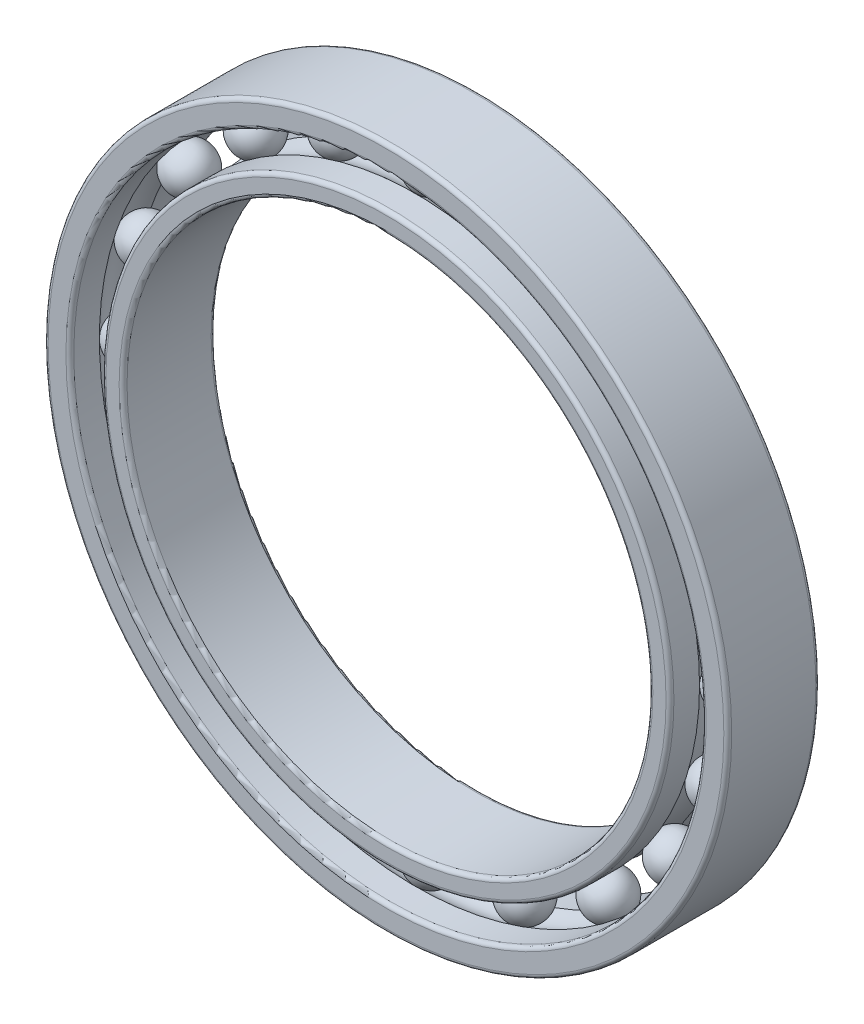
ISO-10303-21;
HEADER;
FILE_DESCRIPTION(('STEP AP214'),'2;1');
FILE_NAME('part.step','',(''),(''),'','','');
FILE_SCHEMA(('AUTOMOTIVE_DESIGN { 1 0 10303 214 1 1 1 1 }'));
ENDSEC;
DATA;
#1=APPLICATION_CONTEXT('core data for automotive mechanical design processes');
#2=APPLICATION_PROTOCOL_DEFINITION('international standard','automotive_design',2000,#1);
#3=PRODUCT_CONTEXT('',#1,'mechanical');
#4=PRODUCT('Part','Part','',(#3));
#5=PRODUCT_RELATED_PRODUCT_CATEGORY('part','',(#4));
#6=PRODUCT_DEFINITION_FORMATION('','',#4);
#7=PRODUCT_DEFINITION_CONTEXT('part definition',#1,'design');
#8=PRODUCT_DEFINITION('design','',#6,#7);
#9=PRODUCT_DEFINITION_SHAPE('','',#8);
#10=(LENGTH_UNIT() NAMED_UNIT(*) SI_UNIT(.MILLI.,.METRE.));
#11=(NAMED_UNIT(*) PLANE_ANGLE_UNIT() SI_UNIT($,.RADIAN.));
#12=(NAMED_UNIT(*) SI_UNIT($,.STERADIAN.) SOLID_ANGLE_UNIT());
#13=UNCERTAINTY_MEASURE_WITH_UNIT(LENGTH_MEASURE(1.E-05),#10,'distance_accuracy_value','');
#14=(GEOMETRIC_REPRESENTATION_CONTEXT(3) GLOBAL_UNCERTAINTY_ASSIGNED_CONTEXT((#13)) GLOBAL_UNIT_ASSIGNED_CONTEXT((#10,
#11,#12)) REPRESENTATION_CONTEXT('',''));
#15=CARTESIAN_POINT('',(0.,0.,0.));
#16=DIRECTION('',(0.,0.,1.));
#17=DIRECTION('',(1.,0.,0.));
#18=AXIS2_PLACEMENT_3D('',#15,#16,#17);
#19=CARTESIAN_POINT('',(7.05408543909383,21.7102426257277,0.));
#20=DIRECTION('',(0.,0.,1.));
#21=DIRECTION('',(0.309016994374935,0.951056516295158,0.));
#22=AXIS2_PLACEMENT_3D('',#19,#20,#21);
#23=SPHERICAL_SURFACE('',#22,1.75);
#24=CARTESIAN_POINT('',(7.05408543909383,21.7102426257277,1.75));
#25=VERTEX_POINT('',#24);
#26=VERTEX_LOOP('',#25);
#27=FACE_BOUND('',#26,.T.);
#28=ADVANCED_FACE('F44',(#27),#23,.T.);
#29=CLOSED_SHELL('',(#28));
#30=MANIFOLD_SOLID_BREP('B2',#29);
#31=CARTESIAN_POINT('',(13.4176678467062,18.4678354390943,0.));
#32=DIRECTION('',(0.,0.,1.));
#33=DIRECTION('',(0.587785252292462,0.809016994374955,0.));
#34=AXIS2_PLACEMENT_3D('',#31,#32,#33);
#35=SPHERICAL_SURFACE('',#34,1.75);
#36=CARTESIAN_POINT('',(13.4176678467062,18.4678354390943,1.75));
#37=VERTEX_POINT('',#36);
#38=VERTEX_LOOP('',#37);
#39=FACE_BOUND('',#38,.T.);
#40=ADVANCED_FACE('F63',(#39),#35,.T.);
#41=CLOSED_SHELL('',(#40));
#42=MANIFOLD_SOLID_BREP('B6',#41);
#43=CARTESIAN_POINT('',(18.4678354390939,13.4176678467067,0.));
#44=DIRECTION('',(0.,0.,1.));
#45=DIRECTION('',(0.80901699437494,0.587785252292483,0.));
#46=AXIS2_PLACEMENT_3D('',#43,#44,#45);
#47=SPHERICAL_SURFACE('',#46,1.75);
#48=CARTESIAN_POINT('',(18.4678354390939,13.4176678467067,1.75));
#49=VERTEX_POINT('',#48);
#50=VERTEX_LOOP('',#49);
#51=FACE_BOUND('',#50,.T.);
#52=ADVANCED_FACE('F82',(#51),#47,.T.);
#53=CLOSED_SHELL('',(#52));
#54=MANIFOLD_SOLID_BREP('B40',#53);
#55=CARTESIAN_POINT('',(21.7102426257275,7.05408543909436,0.));
#56=DIRECTION('',(0.,0.,1.));
#57=DIRECTION('',(0.95105651629515,0.309016994374958,0.));
#58=AXIS2_PLACEMENT_3D('',#55,#56,#57);
#59=SPHERICAL_SURFACE('',#58,1.75);
#60=CARTESIAN_POINT('',(21.7102426257275,7.05408543909436,1.75));
#61=VERTEX_POINT('',#60);
#62=VERTEX_LOOP('',#61);
#63=FACE_BOUND('',#62,.T.);
#64=ADVANCED_FACE('F101',(#63),#59,.T.);
#65=CLOSED_SHELL('',(#64));
#66=MANIFOLD_SOLID_BREP('B59',#65);
#67=CARTESIAN_POINT('',(22.8275,2.39105370787325E-13,0.));
#68=DIRECTION('',(0.,0.,1.));
#69=DIRECTION('',(1.,0.,0.));
#70=AXIS2_PLACEMENT_3D('',#67,#68,#69);
#71=SPHERICAL_SURFACE('',#70,1.75);
#72=CARTESIAN_POINT('',(22.8275,2.39105370787325E-13,1.75));
#73=VERTEX_POINT('',#72);
#74=VERTEX_LOOP('',#73);
#75=FACE_BOUND('',#74,.T.);
#76=ADVANCED_FACE('F120',(#75),#71,.T.);
#77=CLOSED_SHELL('',(#76));
#78=MANIFOLD_SOLID_BREP('B78',#77);
#79=CARTESIAN_POINT('',(21.7102426257277,-7.0540854390939,0.));
#80=DIRECTION('',(0.,0.,1.));
#81=DIRECTION('',(0.951056516295157,-0.309016994374938,0.));
#82=AXIS2_PLACEMENT_3D('',#79,#80,#81);
#83=SPHERICAL_SURFACE('',#82,1.75);
#84=CARTESIAN_POINT('',(21.7102426257277,-7.0540854390939,1.75));
#85=VERTEX_POINT('',#84);
#86=VERTEX_LOOP('',#85);
#87=FACE_BOUND('',#86,.T.);
#88=ADVANCED_FACE('F139',(#87),#83,.T.);
#89=CLOSED_SHELL('',(#88));
#90=MANIFOLD_SOLID_BREP('B97',#89);
#91=CARTESIAN_POINT('',(18.4678354390942,-13.4176678467063,0.));
#92=DIRECTION('',(0.,0.,1.));
#93=DIRECTION('',(0.809016994374953,-0.587785252292465,0.));
#94=AXIS2_PLACEMENT_3D('',#91,#92,#93);
#95=SPHERICAL_SURFACE('',#94,1.75);
#96=CARTESIAN_POINT('',(18.4678354390942,-13.4176678467063,1.75));
#97=VERTEX_POINT('',#96);
#98=VERTEX_LOOP('',#97);
#99=FACE_BOUND('',#98,.T.);
#100=ADVANCED_FACE('F158',(#99),#95,.T.);
#101=CLOSED_SHELL('',(#100));
#102=MANIFOLD_SOLID_BREP('B116',#101);
#103=CARTESIAN_POINT('',(13.4176678467066,-18.467835439094,0.));
#104=DIRECTION('',(0.,0.,1.));
#105=DIRECTION('',(0.58778525229248,-0.809016994374942,0.));
#106=AXIS2_PLACEMENT_3D('',#103,#104,#105);
#107=SPHERICAL_SURFACE('',#106,1.75);
#108=CARTESIAN_POINT('',(13.4176678467066,-18.467835439094,1.75));
#109=VERTEX_POINT('',#108);
#110=VERTEX_LOOP('',#109);
#111=FACE_BOUND('',#110,.T.);
#112=ADVANCED_FACE('F177',(#111),#107,.T.);
#113=CLOSED_SHELL('',(#112));
#114=MANIFOLD_SOLID_BREP('B135',#113);
#115=CARTESIAN_POINT('',(7.05408543909428,-21.7102426257276,0.));
#116=DIRECTION('',(0.,0.,1.));
#117=DIRECTION('',(0.309016994374955,-0.951056516295151,0.));
#118=AXIS2_PLACEMENT_3D('',#115,#116,#117);
#119=SPHERICAL_SURFACE('',#118,1.75);
#120=CARTESIAN_POINT('',(7.05408543909428,-21.7102426257276,1.75));
#121=VERTEX_POINT('',#120);
#122=VERTEX_LOOP('',#121);
#123=FACE_BOUND('',#122,.T.);
#124=ADVANCED_FACE('F196',(#123),#119,.T.);
#125=CLOSED_SHELL('',(#124));
#126=MANIFOLD_SOLID_BREP('B154',#125);
#127=CARTESIAN_POINT('',(0.,-22.8275,0.));
#128=DIRECTION('',(0.,0.,1.));
#129=DIRECTION('',(0.,-1.,0.));
#130=AXIS2_PLACEMENT_3D('',#127,#128,#129);
#131=SPHERICAL_SURFACE('',#130,1.75);
#132=CARTESIAN_POINT('',(0.,-22.8275,1.75));
#133=VERTEX_POINT('',#132);
#134=VERTEX_LOOP('',#133);
#135=FACE_BOUND('',#134,.T.);
#136=ADVANCED_FACE('F215',(#135),#131,.T.);
#137=CLOSED_SHELL('',(#136));
#138=MANIFOLD_SOLID_BREP('B173',#137);
#139=CARTESIAN_POINT('',(-7.05408543909397,-21.7102426257277,0.));
#140=DIRECTION('',(0.,0.,1.));
#141=DIRECTION('',(-0.309016994374941,-0.951056516295156,0.));
#142=AXIS2_PLACEMENT_3D('',#139,#140,#141);
#143=SPHERICAL_SURFACE('',#142,1.75);
#144=CARTESIAN_POINT('',(-7.05408543909397,-21.7102426257277,1.75));
#145=VERTEX_POINT('',#144);
#146=VERTEX_LOOP('',#145);
#147=FACE_BOUND('',#146,.T.);
#148=ADVANCED_FACE('F234',(#147),#143,.T.);
#149=CLOSED_SHELL('',(#148));
#150=MANIFOLD_SOLID_BREP('B192',#149);
#151=CARTESIAN_POINT('',(-13.4176678467063,-18.4678354390942,0.));
#152=DIRECTION('',(0.,0.,1.));
#153=DIRECTION('',(-0.587785252292469,-0.809016994374951,0.));
#154=AXIS2_PLACEMENT_3D('',#151,#152,#153);
#155=SPHERICAL_SURFACE('',#154,1.75);
#156=CARTESIAN_POINT('',(-13.4176678467063,-18.4678354390942,1.75));
#157=VERTEX_POINT('',#156);
#158=VERTEX_LOOP('',#157);
#159=FACE_BOUND('',#158,.T.);
#160=ADVANCED_FACE('F253',(#159),#155,.T.);
#161=CLOSED_SHELL('',(#160));
#162=MANIFOLD_SOLID_BREP('B211',#161);
#163=CARTESIAN_POINT('',(-18.467835439094,-13.4176678467065,0.));
#164=DIRECTION('',(0.,0.,1.));
#165=DIRECTION('',(-0.809016994374945,-0.587785252292477,0.));
#166=AXIS2_PLACEMENT_3D('',#163,#164,#165);
#167=SPHERICAL_SURFACE('',#166,1.75);
#168=CARTESIAN_POINT('',(-18.467835439094,-13.4176678467065,1.75));
#169=VERTEX_POINT('',#168);
#170=VERTEX_LOOP('',#169);
#171=FACE_BOUND('',#170,.T.);
#172=ADVANCED_FACE('F272',(#171),#167,.T.);
#173=CLOSED_SHELL('',(#172));
#174=MANIFOLD_SOLID_BREP('B230',#173);
#175=CARTESIAN_POINT('',(-21.7102426257276,-7.05408543909421,0.));
#176=DIRECTION('',(0.,0.,1.));
#177=DIRECTION('',(-0.951056516295152,-0.309016994374952,0.));
#178=AXIS2_PLACEMENT_3D('',#175,#176,#177);
#179=SPHERICAL_SURFACE('',#178,1.75);
#180=CARTESIAN_POINT('',(-21.7102426257276,-7.05408543909421,1.75));
#181=VERTEX_POINT('',#180);
#182=VERTEX_LOOP('',#181);
#183=FACE_BOUND('',#182,.T.);
#184=ADVANCED_FACE('F291',(#183),#179,.T.);
#185=CLOSED_SHELL('',(#184));
#186=MANIFOLD_SOLID_BREP('B249',#185);
#187=CARTESIAN_POINT('',(-22.8275,0.,0.));
#188=DIRECTION('',(0.,0.,1.));
#189=DIRECTION('',(-1.,0.,0.));
#190=AXIS2_PLACEMENT_3D('',#187,#188,#189);
#191=SPHERICAL_SURFACE('',#190,1.75);
#192=CARTESIAN_POINT('',(-22.8275,0.,1.75));
#193=VERTEX_POINT('',#192);
#194=VERTEX_LOOP('',#193);
#195=FACE_BOUND('',#194,.T.);
#196=ADVANCED_FACE('F310',(#195),#191,.T.);
#197=CLOSED_SHELL('',(#196));
#198=MANIFOLD_SOLID_BREP('B268',#197);
#199=CARTESIAN_POINT('',(-21.7102426257276,7.05408543909405,0.));
#200=DIRECTION('',(0.,0.,1.));
#201=DIRECTION('',(-0.951056516295155,0.309016994374945,0.));
#202=AXIS2_PLACEMENT_3D('',#199,#200,#201);
#203=SPHERICAL_SURFACE('',#202,1.75);
#204=CARTESIAN_POINT('',(-21.7102426257276,7.05408543909405,1.75));
#205=VERTEX_POINT('',#204);
#206=VERTEX_LOOP('',#205);
#207=FACE_BOUND('',#206,.T.);
#208=ADVANCED_FACE('F329',(#207),#203,.T.);
#209=CLOSED_SHELL('',(#208));
#210=MANIFOLD_SOLID_BREP('B287',#209);
#211=CARTESIAN_POINT('',(-18.4678354390941,13.4176678467064,0.));
#212=DIRECTION('',(0.,0.,1.));
#213=DIRECTION('',(-0.809016994374949,0.587785252292471,0.));
#214=AXIS2_PLACEMENT_3D('',#211,#212,#213);
#215=SPHERICAL_SURFACE('',#214,1.75);
#216=CARTESIAN_POINT('',(-18.4678354390941,13.4176678467064,1.75));
#217=VERTEX_POINT('',#216);
#218=VERTEX_LOOP('',#217);
#219=FACE_BOUND('',#218,.T.);
#220=ADVANCED_FACE('F348',(#219),#215,.T.);
#221=CLOSED_SHELL('',(#220));
#222=MANIFOLD_SOLID_BREP('B306',#221);
#223=CARTESIAN_POINT('',(-13.4176678467065,18.4678354390941,0.));
#224=DIRECTION('',(0.,0.,1.));
#225=DIRECTION('',(-0.587785252292474,0.809016994374947,0.));
#226=AXIS2_PLACEMENT_3D('',#223,#224,#225);
#227=SPHERICAL_SURFACE('',#226,1.75);
#228=CARTESIAN_POINT('',(-13.4176678467065,18.4678354390941,1.75));
#229=VERTEX_POINT('',#228);
#230=VERTEX_LOOP('',#229);
#231=FACE_BOUND('',#230,.T.);
#232=ADVANCED_FACE('F367',(#231),#227,.T.);
#233=CLOSED_SHELL('',(#232));
#234=MANIFOLD_SOLID_BREP('B325',#233);
#235=CARTESIAN_POINT('',(-7.05408543909413,21.7102426257276,0.));
#236=DIRECTION('',(0.,0.,1.));
#237=DIRECTION('',(-0.309016994374948,0.951056516295154,0.));
#238=AXIS2_PLACEMENT_3D('',#235,#236,#237);
#239=SPHERICAL_SURFACE('',#238,1.75);
#240=CARTESIAN_POINT('',(-7.05408543909413,21.7102426257276,1.75));
#241=VERTEX_POINT('',#240);
#242=VERTEX_LOOP('',#241);
#243=FACE_BOUND('',#242,.T.);
#244=ADVANCED_FACE('F386',(#243),#239,.T.);
#245=CLOSED_SHELL('',(#244));
#246=MANIFOLD_SOLID_BREP('B344',#245);
#247=CARTESIAN_POINT('',(0.,22.8275,0.));
#248=DIRECTION('',(0.,0.,1.));
#249=DIRECTION('',(0.,1.,0.));
#250=AXIS2_PLACEMENT_3D('',#247,#248,#249);
#251=SPHERICAL_SURFACE('',#250,1.75);
#252=CARTESIAN_POINT('',(0.,22.8275,1.75));
#253=VERTEX_POINT('',#252);
#254=VERTEX_LOOP('',#253);
#255=FACE_BOUND('',#254,.T.);
#256=ADVANCED_FACE('F407',(#255),#251,.T.);
#257=CLOSED_SHELL('',(#256));
#258=MANIFOLD_SOLID_BREP('B363',#257);
#259=CARTESIAN_POINT('',(0.,0.,0.));
#260=DIRECTION('',(0.,0.,1.));
#261=DIRECTION('',(1.,0.,0.));
#262=AXIS2_PLACEMENT_3D('',#259,#260,#261);
#263=TOROIDAL_SURFACE('',#262,22.8275,1.75);
#264=CARTESIAN_POINT('',(0.,0.,-1.25219557178582));
#265=DIRECTION('',(0.,0.,1.));
#266=DIRECTION('',(1.,0.,0.));
#267=AXIS2_PLACEMENT_3D('',#264,#265,#266);
#268=CIRCLE('',#267,21.605);
#269=CARTESIAN_POINT('',(21.605,0.,-1.25219557178582));
#270=VERTEX_POINT('',#269);
#271=EDGE_CURVE('E467',#270,#270,#268,.T.);
#272=ORIENTED_EDGE('',*,*,#271,.T.);
#273=EDGE_LOOP('',(#272));
#274=FACE_BOUND('',#273,.T.);
#275=CARTESIAN_POINT('',(0.,0.,1.25219557178582));
#276=DIRECTION('',(0.,0.,1.));
#277=DIRECTION('',(1.,0.,0.));
#278=AXIS2_PLACEMENT_3D('',#275,#276,#277);
#279=CIRCLE('',#278,21.605);
#280=CARTESIAN_POINT('',(21.605,0.,1.25219557178582));
#281=VERTEX_POINT('',#280);
#282=EDGE_CURVE('E463',#281,#281,#279,.T.);
#283=ORIENTED_EDGE('',*,*,#282,.F.);
#284=EDGE_LOOP('',(#283));
#285=FACE_BOUND('',#284,.T.);
#286=ADVANCED_FACE('F427',(#274,#285),#263,.F.);
#287=CARTESIAN_POINT('',(0.,0.,0.));
#288=DIRECTION('',(0.,0.,1.));
#289=DIRECTION('',(1.,0.,0.));
#290=AXIS2_PLACEMENT_3D('',#287,#288,#289);
#291=CYLINDRICAL_SURFACE('',#290,21.605);
#292=CARTESIAN_POINT('',(0.,0.,3.2));
#293=DIRECTION('',(0.,0.,-1.));
#294=DIRECTION('',(-1.,0.,0.));
#295=AXIS2_PLACEMENT_3D('',#292,#293,#294);
#296=CIRCLE('',#295,21.605);
#297=CARTESIAN_POINT('',(-21.605,0.,3.2));
#298=VERTEX_POINT('',#297);
#299=EDGE_CURVE('E406',#298,#298,#296,.T.);
#300=ORIENTED_EDGE('',*,*,#299,.T.);
#301=EDGE_LOOP('',(#300));
#302=FACE_BOUND('',#301,.T.);
#303=ORIENTED_EDGE('',*,*,#282,.T.);
#304=EDGE_LOOP('',(#303));
#305=FACE_BOUND('',#304,.T.);
#306=ADVANCED_FACE('F490',(#302,#305),#291,.T.);
#307=CARTESIAN_POINT('',(0.,0.,3.5));
#308=DIRECTION('',(0.,0.,-1.));
#309=DIRECTION('',(-1.,0.,0.));
#310=AXIS2_PLACEMENT_3D('',#307,#308,#309);
#311=PLANE('',#310);
#312=CARTESIAN_POINT('',(0.,0.,3.5));
#313=DIRECTION('',(0.,0.,-1.));
#314=DIRECTION('',(-1.,0.,0.));
#315=AXIS2_PLACEMENT_3D('',#312,#313,#314);
#316=CIRCLE('',#315,21.305);
#317=CARTESIAN_POINT('',(-21.305,0.,3.5));
#318=VERTEX_POINT('',#317);
#319=EDGE_CURVE('E435',#318,#318,#316,.F.);
#320=ORIENTED_EDGE('',*,*,#319,.T.);
#321=EDGE_LOOP('',(#320));
#322=FACE_BOUND('',#321,.T.);
#323=CARTESIAN_POINT('',(0.,0.,3.5));
#324=DIRECTION('',(0.,0.,-1.));
#325=DIRECTION('',(-1.,0.,0.));
#326=AXIS2_PLACEMENT_3D('',#323,#324,#325);
#327=CIRCLE('',#326,20.3);
#328=CARTESIAN_POINT('',(-20.3,0.,3.5));
#329=VERTEX_POINT('',#328);
#330=EDGE_CURVE('E440',#329,#329,#327,.T.);
#331=ORIENTED_EDGE('',*,*,#330,.T.);
#332=EDGE_LOOP('',(#331));
#333=FACE_BOUND('',#332,.T.);
#334=ADVANCED_FACE('F495',(#322,#333),#311,.F.);
#335=CARTESIAN_POINT('',(0.,0.,0.));
#336=DIRECTION('',(0.,0.,1.));
#337=DIRECTION('',(1.,0.,0.));
#338=AXIS2_PLACEMENT_3D('',#335,#336,#337);
#339=CYLINDRICAL_SURFACE('',#338,20.);
#340=CARTESIAN_POINT('',(0.,0.,-3.2));
#341=DIRECTION('',(0.,0.,-1.));
#342=DIRECTION('',(-1.,0.,0.));
#343=AXIS2_PLACEMENT_3D('',#340,#341,#342);
#344=CIRCLE('',#343,20.);
#345=CARTESIAN_POINT('',(-20.,0.,-3.2));
#346=VERTEX_POINT('',#345);
#347=EDGE_CURVE('E445',#346,#346,#344,.T.);
#348=ORIENTED_EDGE('',*,*,#347,.T.);
#349=EDGE_LOOP('',(#348));
#350=FACE_BOUND('',#349,.T.);
#351=CARTESIAN_POINT('',(0.,0.,3.2));
#352=DIRECTION('',(0.,0.,-1.));
#353=DIRECTION('',(-1.,0.,0.));
#354=AXIS2_PLACEMENT_3D('',#351,#352,#353);
#355=CIRCLE('',#354,20.);
#356=CARTESIAN_POINT('',(-20.,0.,3.2));
#357=VERTEX_POINT('',#356);
#358=EDGE_CURVE('E450',#357,#357,#355,.F.);
#359=ORIENTED_EDGE('',*,*,#358,.T.);
#360=EDGE_LOOP('',(#359));
#361=FACE_BOUND('',#360,.T.);
#362=ADVANCED_FACE('F486',(#350,#361),#339,.F.);
#363=CARTESIAN_POINT('',(0.,0.,-3.5));
#364=DIRECTION('',(0.,0.,-1.));
#365=DIRECTION('',(-1.,0.,0.));
#366=AXIS2_PLACEMENT_3D('',#363,#364,#365);
#367=PLANE('',#366);
#368=CARTESIAN_POINT('',(0.,0.,-3.5));
#369=DIRECTION('',(0.,0.,-1.));
#370=DIRECTION('',(-1.,0.,0.));
#371=AXIS2_PLACEMENT_3D('',#368,#369,#370);
#372=CIRCLE('',#371,21.305);
#373=CARTESIAN_POINT('',(-21.305,0.,-3.5));
#374=VERTEX_POINT('',#373);
#375=EDGE_CURVE('E454',#374,#374,#372,.T.);
#376=ORIENTED_EDGE('',*,*,#375,.T.);
#377=EDGE_LOOP('',(#376));
#378=FACE_BOUND('',#377,.T.);
#379=CARTESIAN_POINT('',(0.,0.,-3.5));
#380=DIRECTION('',(0.,0.,-1.));
#381=DIRECTION('',(-1.,0.,0.));
#382=AXIS2_PLACEMENT_3D('',#379,#380,#381);
#383=CIRCLE('',#382,20.3);
#384=CARTESIAN_POINT('',(-20.3,0.,-3.5));
#385=VERTEX_POINT('',#384);
#386=EDGE_CURVE('E457',#385,#385,#383,.F.);
#387=ORIENTED_EDGE('',*,*,#386,.T.);
#388=EDGE_LOOP('',(#387));
#389=FACE_BOUND('',#388,.T.);
#390=ADVANCED_FACE('F476',(#378,#389),#367,.T.);
#391=CARTESIAN_POINT('',(0.,0.,0.));
#392=DIRECTION('',(0.,0.,1.));
#393=DIRECTION('',(1.,0.,0.));
#394=AXIS2_PLACEMENT_3D('',#391,#392,#393);
#395=CYLINDRICAL_SURFACE('',#394,21.605);
#396=CARTESIAN_POINT('',(0.,0.,-3.2));
#397=DIRECTION('',(0.,0.,-1.));
#398=DIRECTION('',(-1.,0.,0.));
#399=AXIS2_PLACEMENT_3D('',#396,#397,#398);
#400=CIRCLE('',#399,21.605);
#401=CARTESIAN_POINT('',(-21.605,0.,-3.2));
#402=VERTEX_POINT('',#401);
#403=EDGE_CURVE('E460',#402,#402,#400,.F.);
#404=ORIENTED_EDGE('',*,*,#403,.T.);
#405=EDGE_LOOP('',(#404));
#406=FACE_BOUND('',#405,.T.);
#407=ORIENTED_EDGE('',*,*,#271,.F.);
#408=EDGE_LOOP('',(#407));
#409=FACE_BOUND('',#408,.T.);
#410=ADVANCED_FACE('F473',(#406,#409),#395,.T.);
#411=CARTESIAN_POINT('',(0.,0.,-3.2));
#412=DIRECTION('',(0.,0.,-1.));
#413=DIRECTION('',(-1.,0.,0.));
#414=AXIS2_PLACEMENT_3D('',#411,#412,#413);
#415=TOROIDAL_SURFACE('',#414,21.305,0.3);
#416=ORIENTED_EDGE('',*,*,#375,.F.);
#417=EDGE_LOOP('',(#416));
#418=FACE_BOUND('',#417,.T.);
#419=ORIENTED_EDGE('',*,*,#403,.F.);
#420=EDGE_LOOP('',(#419));
#421=FACE_BOUND('',#420,.T.);
#422=ADVANCED_FACE('F475',(#418,#421),#415,.T.);
#423=CARTESIAN_POINT('',(0.,0.,-3.2));
#424=DIRECTION('',(0.,0.,-1.));
#425=DIRECTION('',(-1.,0.,0.));
#426=AXIS2_PLACEMENT_3D('',#423,#424,#425);
#427=TOROIDAL_SURFACE('',#426,20.3,0.3);
#428=ORIENTED_EDGE('',*,*,#347,.F.);
#429=EDGE_LOOP('',(#428));
#430=FACE_BOUND('',#429,.T.);
#431=ORIENTED_EDGE('',*,*,#386,.F.);
#432=EDGE_LOOP('',(#431));
#433=FACE_BOUND('',#432,.T.);
#434=ADVANCED_FACE('F483',(#430,#433),#427,.T.);
#435=CARTESIAN_POINT('',(0.,0.,3.2));
#436=DIRECTION('',(0.,0.,-1.));
#437=DIRECTION('',(-1.,0.,0.));
#438=AXIS2_PLACEMENT_3D('',#435,#436,#437);
#439=TOROIDAL_SURFACE('',#438,21.305,0.3);
#440=ORIENTED_EDGE('',*,*,#299,.F.);
#441=EDGE_LOOP('',(#440));
#442=FACE_BOUND('',#441,.T.);
#443=ORIENTED_EDGE('',*,*,#319,.F.);
#444=EDGE_LOOP('',(#443));
#445=FACE_BOUND('',#444,.T.);
#446=ADVANCED_FACE('F500',(#442,#445),#439,.T.);
#447=CARTESIAN_POINT('',(0.,0.,3.2));
#448=DIRECTION('',(0.,0.,-1.));
#449=DIRECTION('',(-1.,0.,0.));
#450=AXIS2_PLACEMENT_3D('',#447,#448,#449);
#451=TOROIDAL_SURFACE('',#450,20.3,0.3);
#452=ORIENTED_EDGE('',*,*,#330,.F.);
#453=EDGE_LOOP('',(#452));
#454=FACE_BOUND('',#453,.T.);
#455=ORIENTED_EDGE('',*,*,#358,.F.);
#456=EDGE_LOOP('',(#455));
#457=FACE_BOUND('',#456,.T.);
#458=ADVANCED_FACE('F429',(#454,#457),#451,.T.);
#459=CLOSED_SHELL('',(#286,#306,#334,#362,#390,#410,#422,#434,#446,#458));
#460=MANIFOLD_SOLID_BREP('B382',#459);
#461=CARTESIAN_POINT('',(0.,0.,0.));
#462=DIRECTION('',(0.,0.,1.));
#463=DIRECTION('',(1.,0.,0.));
#464=AXIS2_PLACEMENT_3D('',#461,#462,#463);
#465=TOROIDAL_SURFACE('',#464,22.8275,1.75);
#466=CARTESIAN_POINT('',(0.,0.,1.25219557178582));
#467=DIRECTION('',(0.,0.,1.));
#468=DIRECTION('',(1.,0.,0.));
#469=AXIS2_PLACEMENT_3D('',#466,#467,#468);
#470=CIRCLE('',#469,24.05);
#471=CARTESIAN_POINT('',(24.05,0.,1.25219557178582));
#472=VERTEX_POINT('',#471);
#473=EDGE_CURVE('E625',#472,#472,#470,.T.);
#474=ORIENTED_EDGE('',*,*,#473,.T.);
#475=EDGE_LOOP('',(#474));
#476=FACE_BOUND('',#475,.T.);
#477=CARTESIAN_POINT('',(0.,0.,-1.25219557178582));
#478=DIRECTION('',(0.,0.,1.));
#479=DIRECTION('',(1.,0.,0.));
#480=AXIS2_PLACEMENT_3D('',#477,#478,#479);
#481=CIRCLE('',#480,24.05);
#482=CARTESIAN_POINT('',(24.05,0.,-1.25219557178582));
#483=VERTEX_POINT('',#482);
#484=EDGE_CURVE('E622',#483,#483,#481,.T.);
#485=ORIENTED_EDGE('',*,*,#484,.F.);
#486=EDGE_LOOP('',(#485));
#487=FACE_BOUND('',#486,.T.);
#488=ADVANCED_FACE('F586',(#476,#487),#465,.F.);
#489=CARTESIAN_POINT('',(0.,0.,0.));
#490=DIRECTION('',(0.,0.,1.));
#491=DIRECTION('',(1.,0.,0.));
#492=AXIS2_PLACEMENT_3D('',#489,#490,#491);
#493=CYLINDRICAL_SURFACE('',#492,24.05);
#494=CARTESIAN_POINT('',(0.,0.,-3.2));
#495=DIRECTION('',(0.,0.,-1.));
#496=DIRECTION('',(-1.,0.,0.));
#497=AXIS2_PLACEMENT_3D('',#494,#495,#496);
#498=CIRCLE('',#497,24.05);
#499=CARTESIAN_POINT('',(-24.05,0.,-3.2));
#500=VERTEX_POINT('',#499);
#501=EDGE_CURVE('E613',#500,#500,#498,.T.);
#502=ORIENTED_EDGE('',*,*,#501,.T.);
#503=EDGE_LOOP('',(#502));
#504=FACE_BOUND('',#503,.T.);
#505=ORIENTED_EDGE('',*,*,#484,.T.);
#506=EDGE_LOOP('',(#505));
#507=FACE_BOUND('',#506,.T.);
#508=ADVANCED_FACE('F649',(#504,#507),#493,.F.);
#509=CARTESIAN_POINT('',(0.,0.,-3.5));
#510=DIRECTION('',(0.,0.,-1.));
#511=DIRECTION('',(-1.,0.,0.));
#512=AXIS2_PLACEMENT_3D('',#509,#510,#511);
#513=PLANE('',#512);
#514=CARTESIAN_POINT('',(0.,0.,-3.5));
#515=DIRECTION('',(0.,0.,-1.));
#516=DIRECTION('',(-1.,0.,0.));
#517=AXIS2_PLACEMENT_3D('',#514,#515,#516);
#518=CIRCLE('',#517,24.35);
#519=CARTESIAN_POINT('',(-24.35,0.,-3.5));
#520=VERTEX_POINT('',#519);
#521=EDGE_CURVE('E616',#520,#520,#518,.F.);
#522=ORIENTED_EDGE('',*,*,#521,.T.);
#523=EDGE_LOOP('',(#522));
#524=FACE_BOUND('',#523,.T.);
#525=CARTESIAN_POINT('',(0.,0.,-3.5));
#526=DIRECTION('',(0.,0.,-1.));
#527=DIRECTION('',(-1.,0.,0.));
#528=AXIS2_PLACEMENT_3D('',#525,#526,#527);
#529=CIRCLE('',#528,25.7);
#530=CARTESIAN_POINT('',(-25.7,0.,-3.5));
#531=VERTEX_POINT('',#530);
#532=EDGE_CURVE('E619',#531,#531,#529,.T.);
#533=ORIENTED_EDGE('',*,*,#532,.T.);
#534=EDGE_LOOP('',(#533));
#535=FACE_BOUND('',#534,.T.);
#536=ADVANCED_FACE('F654',(#524,#535),#513,.T.);
#537=CARTESIAN_POINT('',(0.,0.,0.));
#538=DIRECTION('',(0.,0.,1.));
#539=DIRECTION('',(1.,0.,0.));
#540=AXIS2_PLACEMENT_3D('',#537,#538,#539);
#541=CYLINDRICAL_SURFACE('',#540,26.);
#542=CARTESIAN_POINT('',(0.,0.,-3.2));
#543=DIRECTION('',(0.,0.,-1.));
#544=DIRECTION('',(-1.,0.,0.));
#545=AXIS2_PLACEMENT_3D('',#542,#543,#544);
#546=CIRCLE('',#545,26.);
#547=CARTESIAN_POINT('',(-26.,0.,-3.2));
#548=VERTEX_POINT('',#547);
#549=EDGE_CURVE('E426',#548,#548,#546,.F.);
#550=ORIENTED_EDGE('',*,*,#549,.T.);
#551=EDGE_LOOP('',(#550));
#552=FACE_BOUND('',#551,.T.);
#553=CARTESIAN_POINT('',(0.,0.,3.2));
#554=DIRECTION('',(0.,0.,-1.));
#555=DIRECTION('',(-1.,0.,0.));
#556=AXIS2_PLACEMENT_3D('',#553,#554,#555);
#557=CIRCLE('',#556,26.);
#558=CARTESIAN_POINT('',(-26.,0.,3.2));
#559=VERTEX_POINT('',#558);
#560=EDGE_CURVE('E593',#559,#559,#557,.T.);
#561=ORIENTED_EDGE('',*,*,#560,.T.);
#562=EDGE_LOOP('',(#561));
#563=FACE_BOUND('',#562,.T.);
#564=ADVANCED_FACE('F645',(#552,#563),#541,.T.);
#565=CARTESIAN_POINT('',(0.,0.,3.5));
#566=DIRECTION('',(0.,0.,-1.));
#567=DIRECTION('',(-1.,0.,0.));
#568=AXIS2_PLACEMENT_3D('',#565,#566,#567);
#569=PLANE('',#568);
#570=CARTESIAN_POINT('',(0.,0.,3.5));
#571=DIRECTION('',(0.,0.,-1.));
#572=DIRECTION('',(-1.,0.,0.));
#573=AXIS2_PLACEMENT_3D('',#570,#571,#572);
#574=CIRCLE('',#573,24.35);
#575=CARTESIAN_POINT('',(-24.35,0.,3.5));
#576=VERTEX_POINT('',#575);
#577=EDGE_CURVE('E598',#576,#576,#574,.T.);
#578=ORIENTED_EDGE('',*,*,#577,.T.);
#579=EDGE_LOOP('',(#578));
#580=FACE_BOUND('',#579,.T.);
#581=CARTESIAN_POINT('',(0.,0.,3.5));
#582=DIRECTION('',(0.,0.,-1.));
#583=DIRECTION('',(-1.,0.,0.));
#584=AXIS2_PLACEMENT_3D('',#581,#582,#583);
#585=CIRCLE('',#584,25.7);
#586=CARTESIAN_POINT('',(-25.7,0.,3.5));
#587=VERTEX_POINT('',#586);
#588=EDGE_CURVE('E604',#587,#587,#585,.F.);
#589=ORIENTED_EDGE('',*,*,#588,.T.);
#590=EDGE_LOOP('',(#589));
#591=FACE_BOUND('',#590,.T.);
#592=ADVANCED_FACE('F635',(#580,#591),#569,.F.);
#593=CARTESIAN_POINT('',(0.,0.,0.));
#594=DIRECTION('',(0.,0.,1.));
#595=DIRECTION('',(1.,0.,0.));
#596=AXIS2_PLACEMENT_3D('',#593,#594,#595);
#597=CYLINDRICAL_SURFACE('',#596,24.05);
#598=CARTESIAN_POINT('',(0.,0.,3.2));
#599=DIRECTION('',(0.,0.,-1.));
#600=DIRECTION('',(-1.,0.,0.));
#601=AXIS2_PLACEMENT_3D('',#598,#599,#600);
#602=CIRCLE('',#601,24.05);
#603=CARTESIAN_POINT('',(-24.05,0.,3.2));
#604=VERTEX_POINT('',#603);
#605=EDGE_CURVE('E609',#604,#604,#602,.F.);
#606=ORIENTED_EDGE('',*,*,#605,.T.);
#607=EDGE_LOOP('',(#606));
#608=FACE_BOUND('',#607,.T.);
#609=ORIENTED_EDGE('',*,*,#473,.F.);
#610=EDGE_LOOP('',(#609));
#611=FACE_BOUND('',#610,.T.);
#612=ADVANCED_FACE('F632',(#608,#611),#597,.F.);
#613=CARTESIAN_POINT('',(0.,0.,-3.2));
#614=DIRECTION('',(0.,0.,-1.));
#615=DIRECTION('',(-1.,0.,0.));
#616=AXIS2_PLACEMENT_3D('',#613,#614,#615);
#617=TOROIDAL_SURFACE('',#616,24.35,0.3);
#618=ORIENTED_EDGE('',*,*,#501,.F.);
#619=EDGE_LOOP('',(#618));
#620=FACE_BOUND('',#619,.T.);
#621=ORIENTED_EDGE('',*,*,#521,.F.);
#622=EDGE_LOOP('',(#621));
#623=FACE_BOUND('',#622,.T.);
#624=ADVANCED_FACE('F634',(#620,#623),#617,.T.);
#625=CARTESIAN_POINT('',(0.,0.,3.2));
#626=DIRECTION('',(0.,0.,-1.));
#627=DIRECTION('',(-1.,0.,0.));
#628=AXIS2_PLACEMENT_3D('',#625,#626,#627);
#629=TOROIDAL_SURFACE('',#628,24.35,0.3);
#630=ORIENTED_EDGE('',*,*,#577,.F.);
#631=EDGE_LOOP('',(#630));
#632=FACE_BOUND('',#631,.T.);
#633=ORIENTED_EDGE('',*,*,#605,.F.);
#634=EDGE_LOOP('',(#633));
#635=FACE_BOUND('',#634,.T.);
#636=ADVANCED_FACE('F642',(#632,#635),#629,.T.);
#637=CARTESIAN_POINT('',(0.,0.,-3.2));
#638=DIRECTION('',(0.,0.,-1.));
#639=DIRECTION('',(-1.,0.,0.));
#640=AXIS2_PLACEMENT_3D('',#637,#638,#639);
#641=TOROIDAL_SURFACE('',#640,25.7,0.3);
#642=ORIENTED_EDGE('',*,*,#532,.F.);
#643=EDGE_LOOP('',(#642));
#644=FACE_BOUND('',#643,.T.);
#645=ORIENTED_EDGE('',*,*,#549,.F.);
#646=EDGE_LOOP('',(#645));
#647=FACE_BOUND('',#646,.T.);
#648=ADVANCED_FACE('F660',(#644,#647),#641,.T.);
#649=CARTESIAN_POINT('',(0.,0.,3.2));
#650=DIRECTION('',(0.,0.,-1.));
#651=DIRECTION('',(-1.,0.,0.));
#652=AXIS2_PLACEMENT_3D('',#649,#650,#651);
#653=TOROIDAL_SURFACE('',#652,25.7,0.3);
#654=ORIENTED_EDGE('',*,*,#560,.F.);
#655=EDGE_LOOP('',(#654));
#656=FACE_BOUND('',#655,.T.);
#657=ORIENTED_EDGE('',*,*,#588,.F.);
#658=EDGE_LOOP('',(#657));
#659=FACE_BOUND('',#658,.T.);
#660=ADVANCED_FACE('F588',(#656,#659),#653,.T.);
#661=CLOSED_SHELL('',(#488,#508,#536,#564,#592,#612,#624,#636,#648,#660));
#662=MANIFOLD_SOLID_BREP('B401',#661);
#663=ADVANCED_BREP_SHAPE_REPRESENTATION('',(#18,#30,#42,#54,#66,#78,#90,#102,#114,#126,#138,
#150,#162,#174,#186,#198,#210,#222,#234,#246,#258,#460,#662),#14);
#664=SHAPE_DEFINITION_REPRESENTATION(#9,#663);
ENDSEC;
END-ISO-10303-21;
